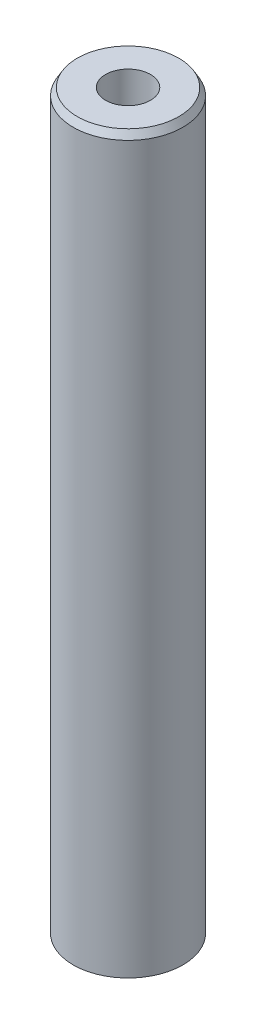
ISO-10303-21;
HEADER;
FILE_DESCRIPTION(('STEP AP214'),'2;1');
FILE_NAME('part.step','',(''),(''),'','','');
FILE_SCHEMA(('AUTOMOTIVE_DESIGN { 1 0 10303 214 1 1 1 1 }'));
ENDSEC;
DATA;
#1=APPLICATION_CONTEXT('core data for automotive mechanical design processes');
#2=APPLICATION_PROTOCOL_DEFINITION('international standard','automotive_design',2000,#1);
#3=PRODUCT_CONTEXT('',#1,'mechanical');
#4=PRODUCT('Part','Part','',(#3));
#5=PRODUCT_RELATED_PRODUCT_CATEGORY('part','',(#4));
#6=PRODUCT_DEFINITION_FORMATION('','',#4);
#7=PRODUCT_DEFINITION_CONTEXT('part definition',#1,'design');
#8=PRODUCT_DEFINITION('design','',#6,#7);
#9=PRODUCT_DEFINITION_SHAPE('','',#8);
#10=(LENGTH_UNIT() NAMED_UNIT(*) SI_UNIT(.MILLI.,.METRE.));
#11=(NAMED_UNIT(*) PLANE_ANGLE_UNIT() SI_UNIT($,.RADIAN.));
#12=(NAMED_UNIT(*) SI_UNIT($,.STERADIAN.) SOLID_ANGLE_UNIT());
#13=UNCERTAINTY_MEASURE_WITH_UNIT(LENGTH_MEASURE(1.E-05),#10,'distance_accuracy_value','');
#14=(GEOMETRIC_REPRESENTATION_CONTEXT(3) GLOBAL_UNCERTAINTY_ASSIGNED_CONTEXT((#13)) GLOBAL_UNIT_ASSIGNED_CONTEXT((#10,
#11,#12)) REPRESENTATION_CONTEXT('',''));
#15=CARTESIAN_POINT('',(0.,0.,0.));
#16=DIRECTION('',(0.,0.,1.));
#17=DIRECTION('',(1.,0.,0.));
#18=AXIS2_PLACEMENT_3D('',#15,#16,#17);
#19=CARTESIAN_POINT('',(0.,503.559410325545,0.));
#20=DIRECTION('',(0.,-1.,0.));
#21=DIRECTION('',(0.,0.,-1.));
#22=AXIS2_PLACEMENT_3D('',#19,#20,#21);
#23=CYLINDRICAL_SURFACE('',#22,37.5);
#24=CARTESIAN_POINT('',(0.,498.664713676814,0.));
#25=DIRECTION('',(0.,1.,0.));
#26=DIRECTION('',(0.,0.,1.));
#27=AXIS2_PLACEMENT_3D('',#24,#25,#26);
#28=CIRCLE('',#27,37.5);
#29=CARTESIAN_POINT('',(0.,498.664713676814,-37.5));
#30=VERTEX_POINT('',#29);
#31=EDGE_CURVE('E50',#30,#30,#28,.F.);
#32=ORIENTED_EDGE('',*,*,#31,.T.);
#33=EDGE_LOOP('',(#32));
#34=FACE_BOUND('',#33,.T.);
#35=CARTESIAN_POINT('',(0.,2.82595442774658,0.));
#36=DIRECTION('',(0.,1.,0.));
#37=DIRECTION('',(0.,0.,1.));
#38=AXIS2_PLACEMENT_3D('',#35,#36,#37);
#39=CIRCLE('',#38,37.5);
#40=CARTESIAN_POINT('',(0.,2.82595442774658,37.5));
#41=VERTEX_POINT('',#40);
#42=EDGE_CURVE('E51',#41,#41,#39,.T.);
#43=ORIENTED_EDGE('',*,*,#42,.T.);
#44=EDGE_LOOP('',(#43));
#45=FACE_BOUND('',#44,.T.);
#46=ADVANCED_FACE('F39',(#34,#45),#23,.T.);
#47=CARTESIAN_POINT('',(0.,503.559410325545,0.));
#48=DIRECTION('',(0.,1.,0.));
#49=DIRECTION('',(0.,0.,1.));
#50=AXIS2_PLACEMENT_3D('',#47,#48,#49);
#51=PLANE('',#50);
#52=CARTESIAN_POINT('',(0.,503.559410325545,0.));
#53=DIRECTION('',(0.,1.,0.));
#54=DIRECTION('',(0.,0.,1.));
#55=AXIS2_PLACEMENT_3D('',#52,#53,#54);
#56=CIRCLE('',#55,34.6740455722532);
#57=CARTESIAN_POINT('',(0.,503.559410325545,-34.6740455722533));
#58=VERTEX_POINT('',#57);
#59=EDGE_CURVE('E54',#58,#58,#56,.T.);
#60=ORIENTED_EDGE('',*,*,#59,.T.);
#61=EDGE_LOOP('',(#60));
#62=FACE_BOUND('',#61,.T.);
#63=CARTESIAN_POINT('',(0.,503.559410325545,0.));
#64=DIRECTION('',(0.,1.,0.));
#65=DIRECTION('',(0.,0.,1.));
#66=AXIS2_PLACEMENT_3D('',#63,#64,#65);
#67=CIRCLE('',#66,15.3453852494668);
#68=CARTESIAN_POINT('',(0.,503.559410325545,15.3453852494668));
#69=VERTEX_POINT('',#68);
#70=EDGE_CURVE('E58',#69,#69,#67,.T.);
#71=ORIENTED_EDGE('',*,*,#70,.F.);
#72=EDGE_LOOP('',(#71));
#73=FACE_BOUND('',#72,.T.);
#74=ADVANCED_FACE('F69',(#62,#73),#51,.T.);
#75=CARTESIAN_POINT('',(0.,0.,0.));
#76=DIRECTION('',(0.,1.,0.));
#77=DIRECTION('',(0.,0.,1.));
#78=AXIS2_PLACEMENT_3D('',#75,#76,#77);
#79=PLANE('',#78);
#80=CARTESIAN_POINT('',(0.,0.,0.));
#81=DIRECTION('',(0.,1.,0.));
#82=DIRECTION('',(0.,0.,1.));
#83=AXIS2_PLACEMENT_3D('',#80,#81,#82);
#84=CIRCLE('',#83,32.6053033512687);
#85=CARTESIAN_POINT('',(0.,0.,32.6053033512687));
#86=VERTEX_POINT('',#85);
#87=EDGE_CURVE('E10',#86,#86,#84,.F.);
#88=ORIENTED_EDGE('',*,*,#87,.T.);
#89=EDGE_LOOP('',(#88));
#90=FACE_BOUND('',#89,.T.);
#91=CARTESIAN_POINT('',(0.,0.,0.));
#92=DIRECTION('',(0.,1.,0.));
#93=DIRECTION('',(0.,0.,1.));
#94=AXIS2_PLACEMENT_3D('',#91,#92,#93);
#95=CIRCLE('',#94,15.3453852494668);
#96=CARTESIAN_POINT('',(0.,0.,15.3453852494668));
#97=VERTEX_POINT('',#96);
#98=EDGE_CURVE('E63',#97,#97,#95,.T.);
#99=ORIENTED_EDGE('',*,*,#98,.T.);
#100=EDGE_LOOP('',(#99));
#101=FACE_BOUND('',#100,.T.);
#102=ADVANCED_FACE('F75',(#90,#101),#79,.F.);
#103=CARTESIAN_POINT('',(0.,503.559410325545,0.));
#104=DIRECTION('',(0.,-1.,0.));
#105=DIRECTION('',(0.,0.,-1.));
#106=AXIS2_PLACEMENT_3D('',#103,#104,#105);
#107=CYLINDRICAL_SURFACE('',#106,15.3453852494668);
#108=ORIENTED_EDGE('',*,*,#70,.T.);
#109=EDGE_LOOP('',(#108));
#110=FACE_BOUND('',#109,.T.);
#111=ORIENTED_EDGE('',*,*,#98,.F.);
#112=EDGE_LOOP('',(#111));
#113=FACE_BOUND('',#112,.T.);
#114=ADVANCED_FACE('F70',(#110,#113),#107,.F.);
#115=CARTESIAN_POINT('',(0.,503.559410325545,0.));
#116=DIRECTION('',(0.,-1.,0.));
#117=DIRECTION('',(0.,0.,-1.));
#118=AXIS2_PLACEMENT_3D('',#115,#116,#117);
#119=CONICAL_SURFACE('',#118,34.6740455722532,0.523598775598308);
#120=CARTESIAN_POINT('',(0.,498.664713676814,-37.5));
#121=CARTESIAN_POINT('',(0.,498.715700100238,-37.470562974711));
#122=CARTESIAN_POINT('',(0.,498.766686523662,-37.441125949422));
#123=CARTESIAN_POINT('',(0.,498.868659370511,-37.3822518988439));
#124=CARTESIAN_POINT('',(0.,498.919645793935,-37.3528148735549));
#125=CARTESIAN_POINT('',(0.,499.021618640784,-37.2939408229768));
#126=CARTESIAN_POINT('',(0.,499.072605064208,-37.2645037976878));
#127=CARTESIAN_POINT('',(0.,499.174577911056,-37.2056297471097));
#128=CARTESIAN_POINT('',(0.,499.225564334481,-37.1761927218207));
#129=CARTESIAN_POINT('',(0.,499.327537181329,-37.1173186712426));
#130=CARTESIAN_POINT('',(0.,499.378523604754,-37.0878816459536));
#131=CARTESIAN_POINT('',(0.,499.480496451602,-37.0290075953756));
#132=CARTESIAN_POINT('',(0.,499.531482875027,-36.9995705700865));
#133=CARTESIAN_POINT('',(0.,499.633455721875,-36.9406965195085));
#134=CARTESIAN_POINT('',(0.,499.684442145299,-36.9112594942195));
#135=CARTESIAN_POINT('',(0.,499.786414992148,-36.8523854436414));
#136=CARTESIAN_POINT('',(0.,499.837401415572,-36.8229484183524));
#137=CARTESIAN_POINT('',(0.,499.939374262421,-36.7640743677743));
#138=CARTESIAN_POINT('',(0.,499.990360685845,-36.7346373424853));
#139=CARTESIAN_POINT('',(0.,500.092333532694,-36.6757632919072));
#140=CARTESIAN_POINT('',(0.,500.143319956118,-36.6463262666182));
#141=CARTESIAN_POINT('',(0.,500.245292802967,-36.5874522160401));
#142=CARTESIAN_POINT('',(0.,500.296279226391,-36.5580151907511));
#143=CARTESIAN_POINT('',(0.,500.398252073239,-36.499141140173));
#144=CARTESIAN_POINT('',(0.,500.449238496664,-36.469704114884));
#145=CARTESIAN_POINT('',(0.,500.551211343512,-36.410830064306));
#146=CARTESIAN_POINT('',(0.,500.602197766937,-36.3813930390169));
#147=CARTESIAN_POINT('',(0.,500.704170613785,-36.3225189884389));
#148=CARTESIAN_POINT('',(0.,500.755157037209,-36.2930819631499));
#149=CARTESIAN_POINT('',(0.,500.857129884058,-36.2342079125718));
#150=CARTESIAN_POINT('',(0.,500.908116307482,-36.2047708872827));
#151=CARTESIAN_POINT('',(0.,501.010089154331,-36.1458968367047));
#152=CARTESIAN_POINT('',(0.,501.061075577755,-36.1164598114157));
#153=CARTESIAN_POINT('',(0.,501.163048424604,-36.0575857608376));
#154=CARTESIAN_POINT('',(0.,501.214034848028,-36.0281487355486));
#155=CARTESIAN_POINT('',(0.,501.316007694876,-35.9692746849705));
#156=CARTESIAN_POINT('',(0.,501.366994118301,-35.9398376596815));
#157=CARTESIAN_POINT('',(0.,501.468966965149,-35.8809636091034));
#158=CARTESIAN_POINT('',(0.,501.519953388574,-35.8515265838144));
#159=CARTESIAN_POINT('',(0.,501.621926235422,-35.7926525332364));
#160=CARTESIAN_POINT('',(0.,501.672912658846,-35.7632155079473));
#161=CARTESIAN_POINT('',(0.,501.774885505695,-35.7043414573693));
#162=CARTESIAN_POINT('',(0.,501.825871929119,-35.6749044320802));
#163=CARTESIAN_POINT('',(0.,501.927844775968,-35.6160303815022));
#164=CARTESIAN_POINT('',(0.,501.978831199392,-35.5865933562132));
#165=CARTESIAN_POINT('',(0.,502.080804046241,-35.5277193056351));
#166=CARTESIAN_POINT('',(0.,502.131790469665,-35.4982822803461));
#167=CARTESIAN_POINT('',(0.,502.233763316514,-35.439408229768));
#168=CARTESIAN_POINT('',(0.,502.284749739938,-35.409971204479));
#169=CARTESIAN_POINT('',(0.,502.386722586787,-35.3510971539009));
#170=CARTESIAN_POINT('',(0.,502.437709010211,-35.3216601286119));
#171=CARTESIAN_POINT('',(0.,502.539681857059,-35.2627860780338));
#172=CARTESIAN_POINT('',(0.,502.590668280484,-35.2333490527448));
#173=CARTESIAN_POINT('',(0.,502.692641127332,-35.1744750021668));
#174=CARTESIAN_POINT('',(0.,502.743627550757,-35.1450379768777));
#175=CARTESIAN_POINT('',(0.,502.845600397605,-35.0861639262997));
#176=CARTESIAN_POINT('',(0.,502.896586821029,-35.0567269010106));
#177=CARTESIAN_POINT('',(0.,502.998559667878,-34.9978528504326));
#178=CARTESIAN_POINT('',(0.,503.049546091302,-34.9684158251435));
#179=CARTESIAN_POINT('',(0.,503.151518938151,-34.9095417745655));
#180=CARTESIAN_POINT('',(0.,503.202505361575,-34.8801047492765));
#181=CARTESIAN_POINT('',(0.,503.304478208424,-34.8212306986984));
#182=CARTESIAN_POINT('',(0.,503.355464631848,-34.7917936734094));
#183=CARTESIAN_POINT('',(0.,503.457437478697,-34.7329196228313));
#184=CARTESIAN_POINT('',(0.,503.508423902121,-34.7034825975423));
#185=CARTESIAN_POINT('',(0.,503.559410325545,-34.6740455722533));
#186=B_SPLINE_CURVE_WITH_KNOTS('',3,(#120,#121,#122,#123,#124,#125,#126,#127,#128,#129,#130,
#131,#132,#133,#134,#135,#136,#137,#138,#139,#140,#141,#142,#143,#144,#145,#146,#147,#148,#149,
#150,#151,#152,#153,#154,#155,#156,#157,#158,#159,#160,#161,#162,#163,#164,#165,#166,#167,#168,
#169,#170,#171,#172,#173,#174,#175,#176,#177,#178,#179,#180,#181,#182,#183,#184,#185),
.UNSPECIFIED.,.F.,.F.,(4,2,2,2,2,2,2,2,2,2,2,2,2,2,2,2,2,2,2,2,2,2,2,2,2,2,2,2,2,2,2,2,4),(0.,
0.176622151734175,0.353244303468351,0.529866455202526,0.706488606936705,0.88311075867088,
1.05973291040506,1.23635506213923,1.41297721387336,1.58959936560759,1.76622151734172,
1.94284366907584,2.11946582081007,2.2960879725442,2.47271012427842,2.64933227601255,
2.82595442774677,3.0025765794809,3.17919873121503,3.35582088294925,3.53244303468339,
3.70906518641761,3.88568733815174,4.06230948988596,4.23893164162009,4.41555379335422,
4.59217594508845,4.76879809682257,4.9454202485568,5.12204240029092,5.29866455202515,
5.47528670375928,5.6519088554935),.UNSPECIFIED.);
#187=EDGE_CURVE('BSEAM81',#30,#58,#186,.T.);
#188=ORIENTED_EDGE('',*,*,#31,.F.);
#189=ORIENTED_EDGE('',*,*,#59,.F.);
#190=ORIENTED_EDGE('',*,*,#187,.T.);
#191=ORIENTED_EDGE('',*,*,#187,.F.);
#192=EDGE_LOOP('',(#188,#190,#189,#191));
#193=FACE_BOUND('',#192,.T.);
#194=ADVANCED_FACE('F81',(#193),#119,.T.);
#195=CARTESIAN_POINT('',(0.,2.82595442774658,0.));
#196=DIRECTION('',(0.,1.,0.));
#197=DIRECTION('',(0.,0.,1.));
#198=AXIS2_PLACEMENT_3D('',#195,#196,#197);
#199=CONICAL_SURFACE('',#198,37.5,1.0471975511966);
#200=ORIENTED_EDGE('',*,*,#87,.F.);
#201=EDGE_LOOP('',(#200));
#202=FACE_BOUND('',#201,.T.);
#203=ORIENTED_EDGE('',*,*,#42,.F.);
#204=EDGE_LOOP('',(#203));
#205=FACE_BOUND('',#204,.T.);
#206=ADVANCED_FACE('F45',(#202,#205),#199,.T.);
#207=CLOSED_SHELL('',(#46,#74,#102,#114,#194,#206));
#208=MANIFOLD_SOLID_BREP('B2',#207);
#209=ADVANCED_BREP_SHAPE_REPRESENTATION('',(#18,#208),#14);
#210=SHAPE_DEFINITION_REPRESENTATION(#9,#209);
ENDSEC;
END-ISO-10303-21;
